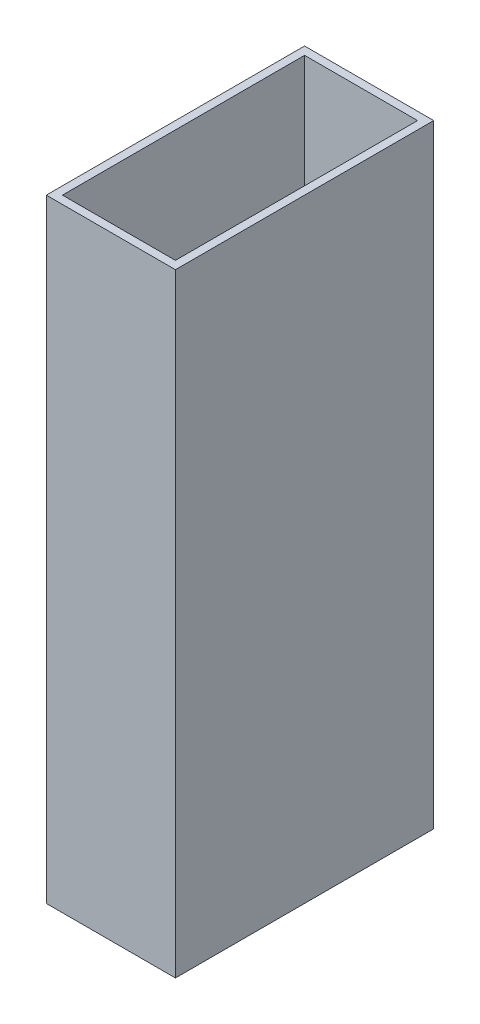
ISO-10303-21;
HEADER;
FILE_DESCRIPTION(('STEP AP214'),'2;1');
FILE_NAME('part.step','',(''),(''),'','','');
FILE_SCHEMA(('AUTOMOTIVE_DESIGN { 1 0 10303 214 1 1 1 1 }'));
ENDSEC;
DATA;
#1=APPLICATION_CONTEXT('core data for automotive mechanical design processes');
#2=APPLICATION_PROTOCOL_DEFINITION('international standard','automotive_design',2000,#1);
#3=PRODUCT_CONTEXT('',#1,'mechanical');
#4=PRODUCT('Part','Part','',(#3));
#5=PRODUCT_RELATED_PRODUCT_CATEGORY('part','',(#4));
#6=PRODUCT_DEFINITION_FORMATION('','',#4);
#7=PRODUCT_DEFINITION_CONTEXT('part definition',#1,'design');
#8=PRODUCT_DEFINITION('design','',#6,#7);
#9=PRODUCT_DEFINITION_SHAPE('','',#8);
#10=(LENGTH_UNIT() NAMED_UNIT(*) SI_UNIT(.MILLI.,.METRE.));
#11=(NAMED_UNIT(*) PLANE_ANGLE_UNIT() SI_UNIT($,.RADIAN.));
#12=(NAMED_UNIT(*) SI_UNIT($,.STERADIAN.) SOLID_ANGLE_UNIT());
#13=UNCERTAINTY_MEASURE_WITH_UNIT(LENGTH_MEASURE(1.E-05),#10,'distance_accuracy_value','');
#14=(GEOMETRIC_REPRESENTATION_CONTEXT(3) GLOBAL_UNCERTAINTY_ASSIGNED_CONTEXT((#13)) GLOBAL_UNIT_ASSIGNED_CONTEXT((#10,
#11,#12)) REPRESENTATION_CONTEXT('',''));
#15=CARTESIAN_POINT('',(0.,0.,0.));
#16=DIRECTION('',(0.,0.,1.));
#17=DIRECTION('',(1.,0.,0.));
#18=AXIS2_PLACEMENT_3D('',#15,#16,#17);
#19=CARTESIAN_POINT('',(0.,120.65,0.));
#20=DIRECTION('',(0.,-1.,0.));
#21=DIRECTION('',(0.,0.,-1.));
#22=AXIS2_PLACEMENT_3D('',#19,#20,#21);
#23=PLANE('',#22);
#24=DIRECTION('',(0.,0.,-1.));
#25=VECTOR('',#24,1.);
#26=CARTESIAN_POINT('',(12.7,120.65,25.4));
#27=LINE('',#26,#25);
#28=CARTESIAN_POINT('',(12.7,120.65,25.4));
#29=VERTEX_POINT('',#28);
#30=CARTESIAN_POINT('',(12.7,120.65,-25.4));
#31=VERTEX_POINT('',#30);
#32=EDGE_CURVE('E133',#29,#31,#27,.T.);
#33=ORIENTED_EDGE('',*,*,#32,.T.);
#34=DIRECTION('',(-1.,0.,0.));
#35=VECTOR('',#34,1.);
#36=CARTESIAN_POINT('',(-12.7,120.65,-25.4));
#37=LINE('',#36,#35);
#38=CARTESIAN_POINT('',(-12.7,120.65,-25.4));
#39=VERTEX_POINT('',#38);
#40=EDGE_CURVE('E136',#31,#39,#37,.T.);
#41=ORIENTED_EDGE('',*,*,#40,.T.);
#42=DIRECTION('',(0.,0.,1.));
#43=VECTOR('',#42,1.);
#44=CARTESIAN_POINT('',(-12.7,120.65,25.4));
#45=LINE('',#44,#43);
#46=CARTESIAN_POINT('',(-12.7,120.65,25.4));
#47=VERTEX_POINT('',#46);
#48=EDGE_CURVE('E139',#39,#47,#45,.T.);
#49=ORIENTED_EDGE('',*,*,#48,.T.);
#50=DIRECTION('',(1.,0.,0.));
#51=VECTOR('',#50,1.);
#52=CARTESIAN_POINT('',(-12.7,120.65,25.4));
#53=LINE('',#52,#51);
#54=EDGE_CURVE('E141',#47,#29,#53,.T.);
#55=ORIENTED_EDGE('',*,*,#54,.T.);
#56=EDGE_LOOP('',(#33,#41,#49,#55));
#57=FACE_BOUND('',#56,.T.);
#58=DIRECTION('',(0.,0.,-1.));
#59=VECTOR('',#58,1.);
#60=CARTESIAN_POINT('',(11.1125,120.65,23.8125));
#61=LINE('',#60,#59);
#62=CARTESIAN_POINT('',(11.1125,120.65,23.8125));
#63=VERTEX_POINT('',#62);
#64=CARTESIAN_POINT('',(11.1125,120.65,-23.8125));
#65=VERTEX_POINT('',#64);
#66=EDGE_CURVE('E97',#63,#65,#61,.T.);
#67=ORIENTED_EDGE('',*,*,#66,.F.);
#68=DIRECTION('',(1.,0.,0.));
#69=VECTOR('',#68,1.);
#70=CARTESIAN_POINT('',(-11.1125,120.65,23.8125));
#71=LINE('',#70,#69);
#72=CARTESIAN_POINT('',(-11.1125,120.65,23.8125));
#73=VERTEX_POINT('',#72);
#74=EDGE_CURVE('E119',#73,#63,#71,.T.);
#75=ORIENTED_EDGE('',*,*,#74,.F.);
#76=DIRECTION('',(0.,0.,1.));
#77=VECTOR('',#76,1.);
#78=CARTESIAN_POINT('',(-11.1125,120.65,23.8125));
#79=LINE('',#78,#77);
#80=CARTESIAN_POINT('',(-11.1125,120.65,-23.8125));
#81=VERTEX_POINT('',#80);
#82=EDGE_CURVE('E117',#81,#73,#79,.T.);
#83=ORIENTED_EDGE('',*,*,#82,.F.);
#84=DIRECTION('',(-1.,0.,0.));
#85=VECTOR('',#84,1.);
#86=CARTESIAN_POINT('',(-11.1125,120.65,-23.8125));
#87=LINE('',#86,#85);
#88=EDGE_CURVE('E105',#65,#81,#87,.T.);
#89=ORIENTED_EDGE('',*,*,#88,.F.);
#90=EDGE_LOOP('',(#67,#75,#83,#89));
#91=FACE_BOUND('',#90,.T.);
#92=ADVANCED_FACE('F32',(#57,#91),#23,.F.);
#93=CARTESIAN_POINT('',(0.,0.,0.));
#94=DIRECTION('',(0.,-1.,0.));
#95=DIRECTION('',(0.,0.,-1.));
#96=AXIS2_PLACEMENT_3D('',#93,#94,#95);
#97=PLANE('',#96);
#98=DIRECTION('',(0.,0.,-1.));
#99=VECTOR('',#98,1.);
#100=CARTESIAN_POINT('',(12.7,0.,25.4));
#101=LINE('',#100,#99);
#102=CARTESIAN_POINT('',(12.7,0.,25.4));
#103=VERTEX_POINT('',#102);
#104=CARTESIAN_POINT('',(12.7,0.,-25.4));
#105=VERTEX_POINT('',#104);
#106=EDGE_CURVE('E113',#103,#105,#101,.T.);
#107=ORIENTED_EDGE('',*,*,#106,.F.);
#108=DIRECTION('',(1.,0.,0.));
#109=VECTOR('',#108,1.);
#110=CARTESIAN_POINT('',(-12.7,0.,25.4));
#111=LINE('',#110,#109);
#112=CARTESIAN_POINT('',(-12.7,0.,25.4));
#113=VERTEX_POINT('',#112);
#114=EDGE_CURVE('E137',#113,#103,#111,.T.);
#115=ORIENTED_EDGE('',*,*,#114,.F.);
#116=DIRECTION('',(0.,0.,1.));
#117=VECTOR('',#116,1.);
#118=CARTESIAN_POINT('',(-12.7,0.,25.4));
#119=LINE('',#118,#117);
#120=CARTESIAN_POINT('',(-12.7,0.,-25.4));
#121=VERTEX_POINT('',#120);
#122=EDGE_CURVE('E148',#121,#113,#119,.T.);
#123=ORIENTED_EDGE('',*,*,#122,.F.);
#124=DIRECTION('',(-1.,0.,0.));
#125=VECTOR('',#124,1.);
#126=CARTESIAN_POINT('',(-12.7,0.,-25.4));
#127=LINE('',#126,#125);
#128=EDGE_CURVE('E146',#105,#121,#127,.T.);
#129=ORIENTED_EDGE('',*,*,#128,.F.);
#130=EDGE_LOOP('',(#107,#115,#123,#129));
#131=FACE_BOUND('',#130,.T.);
#132=DIRECTION('',(1.,0.,0.));
#133=VECTOR('',#132,1.);
#134=CARTESIAN_POINT('',(-11.1125,0.,23.8125));
#135=LINE('',#134,#133);
#136=CARTESIAN_POINT('',(-11.1125,0.,23.8125));
#137=VERTEX_POINT('',#136);
#138=CARTESIAN_POINT('',(11.1125,0.,23.8125));
#139=VERTEX_POINT('',#138);
#140=EDGE_CURVE('E106',#137,#139,#135,.T.);
#141=ORIENTED_EDGE('',*,*,#140,.T.);
#142=DIRECTION('',(0.,0.,-1.));
#143=VECTOR('',#142,1.);
#144=CARTESIAN_POINT('',(11.1125,0.,23.8125));
#145=LINE('',#144,#143);
#146=CARTESIAN_POINT('',(11.1125,0.,-23.8125));
#147=VERTEX_POINT('',#146);
#148=EDGE_CURVE('E55',#139,#147,#145,.T.);
#149=ORIENTED_EDGE('',*,*,#148,.T.);
#150=DIRECTION('',(-1.,0.,0.));
#151=VECTOR('',#150,1.);
#152=CARTESIAN_POINT('',(-11.1125,0.,-23.8125));
#153=LINE('',#152,#151);
#154=CARTESIAN_POINT('',(-11.1125,0.,-23.8125));
#155=VERTEX_POINT('',#154);
#156=EDGE_CURVE('E112',#147,#155,#153,.T.);
#157=ORIENTED_EDGE('',*,*,#156,.T.);
#158=DIRECTION('',(0.,0.,1.));
#159=VECTOR('',#158,1.);
#160=CARTESIAN_POINT('',(-11.1125,0.,23.8125));
#161=LINE('',#160,#159);
#162=EDGE_CURVE('E125',#155,#137,#161,.T.);
#163=ORIENTED_EDGE('',*,*,#162,.T.);
#164=EDGE_LOOP('',(#141,#149,#157,#163));
#165=FACE_BOUND('',#164,.T.);
#166=ADVANCED_FACE('F166',(#131,#165),#97,.T.);
#167=CARTESIAN_POINT('',(12.7,120.65,25.4));
#168=DIRECTION('',(-1.,0.,0.));
#169=DIRECTION('',(0.,0.,1.));
#170=AXIS2_PLACEMENT_3D('',#167,#168,#169);
#171=PLANE('',#170);
#172=ORIENTED_EDGE('',*,*,#106,.T.);
#173=DIRECTION('',(0.,-1.,0.));
#174=VECTOR('',#173,1.);
#175=CARTESIAN_POINT('',(12.7,120.65,-25.4));
#176=LINE('',#175,#174);
#177=EDGE_CURVE('E11',#31,#105,#176,.T.);
#178=ORIENTED_EDGE('',*,*,#177,.F.);
#179=ORIENTED_EDGE('',*,*,#32,.F.);
#180=DIRECTION('',(0.,-1.,0.));
#181=VECTOR('',#180,1.);
#182=CARTESIAN_POINT('',(12.7,120.65,25.4));
#183=LINE('',#182,#181);
#184=EDGE_CURVE('E143',#29,#103,#183,.T.);
#185=ORIENTED_EDGE('',*,*,#184,.T.);
#186=EDGE_LOOP('',(#172,#178,#179,#185));
#187=FACE_BOUND('',#186,.T.);
#188=ADVANCED_FACE('F34',(#187),#171,.F.);
#189=CARTESIAN_POINT('',(-12.7,120.65,-25.4));
#190=DIRECTION('',(0.,0.,1.));
#191=DIRECTION('',(1.,0.,0.));
#192=AXIS2_PLACEMENT_3D('',#189,#190,#191);
#193=PLANE('',#192);
#194=ORIENTED_EDGE('',*,*,#128,.T.);
#195=DIRECTION('',(0.,-1.,0.));
#196=VECTOR('',#195,1.);
#197=CARTESIAN_POINT('',(-12.7,120.65,-25.4));
#198=LINE('',#197,#196);
#199=EDGE_CURVE('E40',#39,#121,#198,.T.);
#200=ORIENTED_EDGE('',*,*,#199,.F.);
#201=ORIENTED_EDGE('',*,*,#40,.F.);
#202=ORIENTED_EDGE('',*,*,#177,.T.);
#203=EDGE_LOOP('',(#194,#200,#201,#202));
#204=FACE_BOUND('',#203,.T.);
#205=ADVANCED_FACE('F176',(#204),#193,.F.);
#206=CARTESIAN_POINT('',(-12.7,120.65,25.4));
#207=DIRECTION('',(1.,0.,0.));
#208=DIRECTION('',(0.,0.,-1.));
#209=AXIS2_PLACEMENT_3D('',#206,#207,#208);
#210=PLANE('',#209);
#211=ORIENTED_EDGE('',*,*,#122,.T.);
#212=DIRECTION('',(0.,-1.,0.));
#213=VECTOR('',#212,1.);
#214=CARTESIAN_POINT('',(-12.7,120.65,25.4));
#215=LINE('',#214,#213);
#216=EDGE_CURVE('E153',#47,#113,#215,.T.);
#217=ORIENTED_EDGE('',*,*,#216,.F.);
#218=ORIENTED_EDGE('',*,*,#48,.F.);
#219=ORIENTED_EDGE('',*,*,#199,.T.);
#220=EDGE_LOOP('',(#211,#217,#218,#219));
#221=FACE_BOUND('',#220,.T.);
#222=ADVANCED_FACE('F160',(#221),#210,.F.);
#223=CARTESIAN_POINT('',(-12.7,120.65,25.4));
#224=DIRECTION('',(0.,0.,-1.));
#225=DIRECTION('',(-1.,0.,0.));
#226=AXIS2_PLACEMENT_3D('',#223,#224,#225);
#227=PLANE('',#226);
#228=ORIENTED_EDGE('',*,*,#114,.T.);
#229=ORIENTED_EDGE('',*,*,#184,.F.);
#230=ORIENTED_EDGE('',*,*,#54,.F.);
#231=ORIENTED_EDGE('',*,*,#216,.T.);
#232=EDGE_LOOP('',(#228,#229,#230,#231));
#233=FACE_BOUND('',#232,.T.);
#234=ADVANCED_FACE('F170',(#233),#227,.F.);
#235=CARTESIAN_POINT('',(11.1125,120.65,23.8125));
#236=DIRECTION('',(-1.,0.,0.));
#237=DIRECTION('',(0.,0.,1.));
#238=AXIS2_PLACEMENT_3D('',#235,#236,#237);
#239=PLANE('',#238);
#240=ORIENTED_EDGE('',*,*,#148,.F.);
#241=DIRECTION('',(0.,-1.,0.));
#242=VECTOR('',#241,1.);
#243=CARTESIAN_POINT('',(11.1125,120.65,23.8125));
#244=LINE('',#243,#242);
#245=EDGE_CURVE('E101',#63,#139,#244,.T.);
#246=ORIENTED_EDGE('',*,*,#245,.F.);
#247=ORIENTED_EDGE('',*,*,#66,.T.);
#248=DIRECTION('',(0.,-1.,0.));
#249=VECTOR('',#248,1.);
#250=CARTESIAN_POINT('',(11.1125,120.65,-23.8125));
#251=LINE('',#250,#249);
#252=EDGE_CURVE('E100',#65,#147,#251,.T.);
#253=ORIENTED_EDGE('',*,*,#252,.T.);
#254=EDGE_LOOP('',(#240,#246,#247,#253));
#255=FACE_BOUND('',#254,.T.);
#256=ADVANCED_FACE('F99',(#255),#239,.T.);
#257=CARTESIAN_POINT('',(-11.1125,120.65,-23.8125));
#258=DIRECTION('',(0.,0.,1.));
#259=DIRECTION('',(1.,0.,0.));
#260=AXIS2_PLACEMENT_3D('',#257,#258,#259);
#261=PLANE('',#260);
#262=ORIENTED_EDGE('',*,*,#156,.F.);
#263=ORIENTED_EDGE('',*,*,#252,.F.);
#264=ORIENTED_EDGE('',*,*,#88,.T.);
#265=DIRECTION('',(0.,-1.,0.));
#266=VECTOR('',#265,1.);
#267=CARTESIAN_POINT('',(-11.1125,120.65,-23.8125));
#268=LINE('',#267,#266);
#269=EDGE_CURVE('E114',#81,#155,#268,.T.);
#270=ORIENTED_EDGE('',*,*,#269,.T.);
#271=EDGE_LOOP('',(#262,#263,#264,#270));
#272=FACE_BOUND('',#271,.T.);
#273=ADVANCED_FACE('F109',(#272),#261,.T.);
#274=CARTESIAN_POINT('',(-11.1125,120.65,23.8125));
#275=DIRECTION('',(1.,0.,0.));
#276=DIRECTION('',(0.,0.,-1.));
#277=AXIS2_PLACEMENT_3D('',#274,#275,#276);
#278=PLANE('',#277);
#279=ORIENTED_EDGE('',*,*,#162,.F.);
#280=ORIENTED_EDGE('',*,*,#269,.F.);
#281=ORIENTED_EDGE('',*,*,#82,.T.);
#282=DIRECTION('',(0.,-1.,0.));
#283=VECTOR('',#282,1.);
#284=CARTESIAN_POINT('',(-11.1125,120.65,23.8125));
#285=LINE('',#284,#283);
#286=EDGE_CURVE('E47',#73,#137,#285,.T.);
#287=ORIENTED_EDGE('',*,*,#286,.T.);
#288=EDGE_LOOP('',(#279,#280,#281,#287));
#289=FACE_BOUND('',#288,.T.);
#290=ADVANCED_FACE('F199',(#289),#278,.T.);
#291=CARTESIAN_POINT('',(-11.1125,120.65,23.8125));
#292=DIRECTION('',(0.,0.,-1.));
#293=DIRECTION('',(-1.,0.,0.));
#294=AXIS2_PLACEMENT_3D('',#291,#292,#293);
#295=PLANE('',#294);
#296=ORIENTED_EDGE('',*,*,#140,.F.);
#297=ORIENTED_EDGE('',*,*,#286,.F.);
#298=ORIENTED_EDGE('',*,*,#74,.T.);
#299=ORIENTED_EDGE('',*,*,#245,.T.);
#300=EDGE_LOOP('',(#296,#297,#298,#299));
#301=FACE_BOUND('',#300,.T.);
#302=ADVANCED_FACE('F203',(#301),#295,.T.);
#303=CLOSED_SHELL('',(#92,#166,#188,#205,#222,#234,#256,#273,#290,#302));
#304=MANIFOLD_SOLID_BREP('B2',#303);
#305=ADVANCED_BREP_SHAPE_REPRESENTATION('',(#18,#304),#14);
#306=SHAPE_DEFINITION_REPRESENTATION(#9,#305);
ENDSEC;
END-ISO-10303-21;
